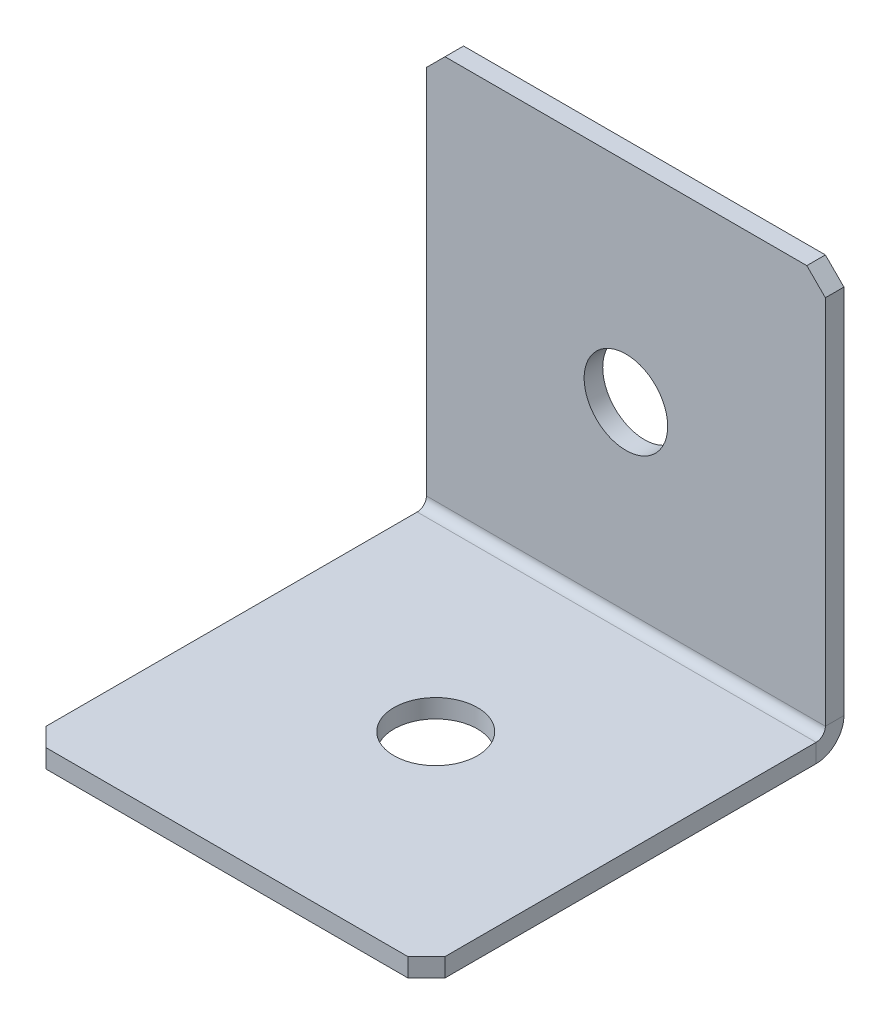
ISO-10303-21;
HEADER;
FILE_DESCRIPTION(('STEP AP214'),'2;1');
FILE_NAME('part.step','',(''),(''),'','','');
FILE_SCHEMA(('AUTOMOTIVE_DESIGN { 1 0 10303 214 1 1 1 1 }'));
ENDSEC;
DATA;
#1=APPLICATION_CONTEXT('core data for automotive mechanical design processes');
#2=APPLICATION_PROTOCOL_DEFINITION('international standard','automotive_design',2000,#1);
#3=PRODUCT_CONTEXT('',#1,'mechanical');
#4=PRODUCT('Part','Part','',(#3));
#5=PRODUCT_RELATED_PRODUCT_CATEGORY('part','',(#4));
#6=PRODUCT_DEFINITION_FORMATION('','',#4);
#7=PRODUCT_DEFINITION_CONTEXT('part definition',#1,'design');
#8=PRODUCT_DEFINITION('design','',#6,#7);
#9=PRODUCT_DEFINITION_SHAPE('','',#8);
#10=(LENGTH_UNIT() NAMED_UNIT(*) SI_UNIT(.MILLI.,.METRE.));
#11=(NAMED_UNIT(*) PLANE_ANGLE_UNIT() SI_UNIT($,.RADIAN.));
#12=(NAMED_UNIT(*) SI_UNIT($,.STERADIAN.) SOLID_ANGLE_UNIT());
#13=UNCERTAINTY_MEASURE_WITH_UNIT(LENGTH_MEASURE(1.E-05),#10,'distance_accuracy_value','');
#14=(GEOMETRIC_REPRESENTATION_CONTEXT(3) GLOBAL_UNCERTAINTY_ASSIGNED_CONTEXT((#13)) GLOBAL_UNIT_ASSIGNED_CONTEXT((#10,
#11,#12)) REPRESENTATION_CONTEXT('',''));
#15=CARTESIAN_POINT('',(0.,0.,0.));
#16=DIRECTION('',(0.,0.,1.));
#17=DIRECTION('',(1.,0.,0.));
#18=AXIS2_PLACEMENT_3D('',#15,#16,#17);
#19=CARTESIAN_POINT('',(0.,0.,2.));
#20=DIRECTION('',(0.,0.,-1.));
#21=DIRECTION('',(-1.,0.,0.));
#22=AXIS2_PLACEMENT_3D('',#19,#20,#21);
#23=PLANE('',#22);
#24=DIRECTION('',(0.,1.,0.));
#25=VECTOR('',#24,1.);
#26=CARTESIAN_POINT('',(21.5,0.,2.));
#27=LINE('',#26,#25);
#28=CARTESIAN_POINT('',(21.5,3.,2.));
#29=VERTEX_POINT('',#28);
#30=CARTESIAN_POINT('',(21.5,43.,2.));
#31=VERTEX_POINT('',#30);
#32=EDGE_CURVE('E224',#29,#31,#27,.T.);
#33=ORIENTED_EDGE('',*,*,#32,.T.);
#34=DIRECTION('',(0.707106781186549,-0.707106781186546,0.));
#35=VECTOR('',#34,1.);
#36=CARTESIAN_POINT('',(21.5,43.,2.));
#37=LINE('',#36,#35);
#38=CARTESIAN_POINT('',(19.5,45.,2.));
#39=VERTEX_POINT('',#38);
#40=EDGE_CURVE('E258',#31,#39,#37,.F.);
#41=ORIENTED_EDGE('',*,*,#40,.T.);
#42=DIRECTION('',(-1.,0.,0.));
#43=VECTOR('',#42,1.);
#44=CARTESIAN_POINT('',(-21.5,45.,2.));
#45=LINE('',#44,#43);
#46=CARTESIAN_POINT('',(-19.5,45.,2.));
#47=VERTEX_POINT('',#46);
#48=EDGE_CURVE('E228',#39,#47,#45,.T.);
#49=ORIENTED_EDGE('',*,*,#48,.T.);
#50=DIRECTION('',(0.707106781186546,0.707106781186549,0.));
#51=VECTOR('',#50,1.);
#52=CARTESIAN_POINT('',(-19.5,45.,2.));
#53=LINE('',#52,#51);
#54=CARTESIAN_POINT('',(-21.5,43.,2.));
#55=VERTEX_POINT('',#54);
#56=EDGE_CURVE('E256',#47,#55,#53,.F.);
#57=ORIENTED_EDGE('',*,*,#56,.T.);
#58=DIRECTION('',(0.,-1.,0.));
#59=VECTOR('',#58,1.);
#60=CARTESIAN_POINT('',(-21.5,0.,2.));
#61=LINE('',#60,#59);
#62=CARTESIAN_POINT('',(-21.5,3.,2.));
#63=VERTEX_POINT('',#62);
#64=EDGE_CURVE('E222',#55,#63,#61,.T.);
#65=ORIENTED_EDGE('',*,*,#64,.T.);
#66=DIRECTION('',(1.,0.,0.));
#67=VECTOR('',#66,1.);
#68=CARTESIAN_POINT('',(21.5,3.,2.));
#69=LINE('',#68,#67);
#70=EDGE_CURVE('E213',#29,#63,#69,.F.);
#71=ORIENTED_EDGE('',*,*,#70,.F.);
#72=EDGE_LOOP('',(#33,#41,#49,#57,#65,#71));
#73=FACE_BOUND('',#72,.T.);
#74=CARTESIAN_POINT('',(0.,22.5,2.));
#75=DIRECTION('',(0.,0.,1.));
#76=DIRECTION('',(1.,0.,0.));
#77=AXIS2_PLACEMENT_3D('',#74,#75,#76);
#78=CIRCLE('',#77,4.5);
#79=CARTESIAN_POINT('',(4.5,22.5,2.));
#80=VERTEX_POINT('',#79);
#81=EDGE_CURVE('E516',#80,#80,#78,.T.);
#82=ORIENTED_EDGE('',*,*,#81,.F.);
#83=EDGE_LOOP('',(#82));
#84=FACE_BOUND('',#83,.T.);
#85=ADVANCED_FACE('F62',(#73,#84),#23,.F.);
#86=CARTESIAN_POINT('',(21.5,0.,2.));
#87=DIRECTION('',(-1.,0.,0.));
#88=DIRECTION('',(0.,1.,0.));
#89=AXIS2_PLACEMENT_3D('',#86,#87,#88);
#90=PLANE('',#89);
#91=DIRECTION('',(0.,1.,0.));
#92=VECTOR('',#91,1.);
#93=CARTESIAN_POINT('',(21.5,0.,0.));
#94=LINE('',#93,#92);
#95=CARTESIAN_POINT('',(21.5,3.,0.));
#96=VERTEX_POINT('',#95);
#97=CARTESIAN_POINT('',(21.5,43.,0.));
#98=VERTEX_POINT('',#97);
#99=EDGE_CURVE('E233',#96,#98,#94,.T.);
#100=ORIENTED_EDGE('',*,*,#99,.T.);
#101=DIRECTION('',(0.,0.,-1.));
#102=VECTOR('',#101,1.);
#103=CARTESIAN_POINT('',(21.5,43.,2.));
#104=LINE('',#103,#102);
#105=EDGE_CURVE('E253',#98,#31,#104,.F.);
#106=ORIENTED_EDGE('',*,*,#105,.T.);
#107=ORIENTED_EDGE('',*,*,#32,.F.);
#108=DIRECTION('',(0.,0.,-1.));
#109=VECTOR('',#108,1.);
#110=CARTESIAN_POINT('',(21.5,3.,2.));
#111=LINE('',#110,#109);
#112=EDGE_CURVE('E209',#29,#96,#111,.T.);
#113=ORIENTED_EDGE('',*,*,#112,.T.);
#114=EDGE_LOOP('',(#100,#106,#107,#113));
#115=FACE_BOUND('',#114,.T.);
#116=ADVANCED_FACE('F272',(#115),#90,.F.);
#117=CARTESIAN_POINT('',(0.,0.,0.));
#118=DIRECTION('',(0.,0.,-1.));
#119=DIRECTION('',(-1.,0.,0.));
#120=AXIS2_PLACEMENT_3D('',#117,#118,#119);
#121=PLANE('',#120);
#122=CARTESIAN_POINT('',(0.,22.5,0.));
#123=DIRECTION('',(0.,0.,-1.));
#124=DIRECTION('',(-1.,0.,0.));
#125=AXIS2_PLACEMENT_3D('',#122,#123,#124);
#126=CIRCLE('',#125,4.5);
#127=CARTESIAN_POINT('',(-4.5,22.5,0.));
#128=VERTEX_POINT('',#127);
#129=EDGE_CURVE('E206',#128,#128,#126,.T.);
#130=ORIENTED_EDGE('',*,*,#129,.F.);
#131=EDGE_LOOP('',(#130));
#132=FACE_BOUND('',#131,.T.);
#133=DIRECTION('',(-1.,0.,0.));
#134=VECTOR('',#133,1.);
#135=CARTESIAN_POINT('',(0.,45.,0.));
#136=LINE('',#135,#134);
#137=CARTESIAN_POINT('',(19.5,45.,0.));
#138=VERTEX_POINT('',#137);
#139=CARTESIAN_POINT('',(-19.5,45.,0.));
#140=VERTEX_POINT('',#139);
#141=EDGE_CURVE('E225',#138,#140,#136,.T.);
#142=ORIENTED_EDGE('',*,*,#141,.F.);
#143=DIRECTION('',(-0.707106781186549,0.707106781186546,0.));
#144=VECTOR('',#143,1.);
#145=CARTESIAN_POINT('',(32.25,32.2500000000001,0.));
#146=LINE('',#145,#144);
#147=EDGE_CURVE('E71',#138,#98,#146,.F.);
#148=ORIENTED_EDGE('',*,*,#147,.T.);
#149=ORIENTED_EDGE('',*,*,#99,.F.);
#150=DIRECTION('',(1.,0.,0.));
#151=VECTOR('',#150,1.);
#152=CARTESIAN_POINT('',(21.5,3.,0.));
#153=LINE('',#152,#151);
#154=CARTESIAN_POINT('',(-21.5,3.00000000000001,0.));
#155=VERTEX_POINT('',#154);
#156=EDGE_CURVE('E160',#96,#155,#153,.F.);
#157=ORIENTED_EDGE('',*,*,#156,.T.);
#158=DIRECTION('',(0.,1.,0.));
#159=VECTOR('',#158,1.);
#160=CARTESIAN_POINT('',(-21.5,0.,0.));
#161=LINE('',#160,#159);
#162=CARTESIAN_POINT('',(-21.5,43.,0.));
#163=VERTEX_POINT('',#162);
#164=EDGE_CURVE('E220',#163,#155,#161,.F.);
#165=ORIENTED_EDGE('',*,*,#164,.F.);
#166=DIRECTION('',(-0.707106781186546,-0.707106781186549,0.));
#167=VECTOR('',#166,1.);
#168=CARTESIAN_POINT('',(-32.25,32.2499999999999,0.));
#169=LINE('',#168,#167);
#170=EDGE_CURVE('E83',#163,#140,#169,.F.);
#171=ORIENTED_EDGE('',*,*,#170,.T.);
#172=EDGE_LOOP('',(#142,#148,#149,#157,#165,#171));
#173=FACE_BOUND('',#172,.T.);
#174=ADVANCED_FACE('F267',(#132,#173),#121,.T.);
#175=CARTESIAN_POINT('',(-21.5,45.,2.));
#176=DIRECTION('',(0.,-1.,0.));
#177=DIRECTION('',(-1.,0.,0.));
#178=AXIS2_PLACEMENT_3D('',#175,#176,#177);
#179=PLANE('',#178);
#180=ORIENTED_EDGE('',*,*,#48,.F.);
#181=DIRECTION('',(0.,0.,1.));
#182=VECTOR('',#181,1.);
#183=CARTESIAN_POINT('',(19.5,45.,2.));
#184=LINE('',#183,#182);
#185=EDGE_CURVE('E263',#39,#138,#184,.F.);
#186=ORIENTED_EDGE('',*,*,#185,.T.);
#187=ORIENTED_EDGE('',*,*,#141,.T.);
#188=DIRECTION('',(0.,0.,-1.));
#189=VECTOR('',#188,1.);
#190=CARTESIAN_POINT('',(-19.5,45.,2.));
#191=LINE('',#190,#189);
#192=EDGE_CURVE('E260',#140,#47,#191,.F.);
#193=ORIENTED_EDGE('',*,*,#192,.T.);
#194=EDGE_LOOP('',(#180,#186,#187,#193));
#195=FACE_BOUND('',#194,.T.);
#196=ADVANCED_FACE('F280',(#195),#179,.F.);
#197=CARTESIAN_POINT('',(-21.5,0.,2.));
#198=DIRECTION('',(1.,0.,0.));
#199=DIRECTION('',(0.,-1.,0.));
#200=AXIS2_PLACEMENT_3D('',#197,#198,#199);
#201=PLANE('',#200);
#202=ORIENTED_EDGE('',*,*,#64,.F.);
#203=DIRECTION('',(0.,0.,1.));
#204=VECTOR('',#203,1.);
#205=CARTESIAN_POINT('',(-21.5,43.,2.));
#206=LINE('',#205,#204);
#207=EDGE_CURVE('E13',#55,#163,#206,.F.);
#208=ORIENTED_EDGE('',*,*,#207,.T.);
#209=ORIENTED_EDGE('',*,*,#164,.T.);
#210=DIRECTION('',(0.,0.,-1.));
#211=VECTOR('',#210,1.);
#212=CARTESIAN_POINT('',(-21.5,3.,2.));
#213=LINE('',#212,#211);
#214=EDGE_CURVE('E217',#63,#155,#213,.T.);
#215=ORIENTED_EDGE('',*,*,#214,.F.);
#216=EDGE_LOOP('',(#202,#208,#209,#215));
#217=FACE_BOUND('',#216,.T.);
#218=ADVANCED_FACE('F284',(#217),#201,.F.);
#219=CARTESIAN_POINT('',(-21.5,3.,3.));
#220=DIRECTION('',(-1.,0.,0.));
#221=DIRECTION('',(0.,0.,1.));
#222=AXIS2_PLACEMENT_3D('',#219,#220,#221);
#223=PLANE('',#222);
#224=DIRECTION('',(0.,1.,0.));
#225=VECTOR('',#224,1.);
#226=CARTESIAN_POINT('',(-21.5,0.,2.99999999999999));
#227=LINE('',#226,#225);
#228=CARTESIAN_POINT('',(-21.5,2.,3.));
#229=VERTEX_POINT('',#228);
#230=CARTESIAN_POINT('',(-21.5,0.,2.99999999999999));
#231=VERTEX_POINT('',#230);
#232=EDGE_CURVE('E203',#229,#231,#227,.F.);
#233=ORIENTED_EDGE('',*,*,#232,.F.);
#234=CARTESIAN_POINT('',(-21.5,3.,3.));
#235=DIRECTION('',(1.,0.,0.));
#236=DIRECTION('',(0.,0.,-1.));
#237=AXIS2_PLACEMENT_3D('',#234,#235,#236);
#238=CIRCLE('',#237,1.);
#239=EDGE_CURVE('E163',#63,#229,#238,.F.);
#240=ORIENTED_EDGE('',*,*,#239,.F.);
#241=ORIENTED_EDGE('',*,*,#214,.T.);
#242=CARTESIAN_POINT('',(-21.5,3.,3.));
#243=DIRECTION('',(1.,0.,0.));
#244=DIRECTION('',(0.,0.,-1.));
#245=AXIS2_PLACEMENT_3D('',#242,#243,#244);
#246=CIRCLE('',#245,3.);
#247=EDGE_CURVE('E208',#155,#231,#246,.F.);
#248=ORIENTED_EDGE('',*,*,#247,.T.);
#249=EDGE_LOOP('',(#233,#240,#241,#248));
#250=FACE_BOUND('',#249,.T.);
#251=ADVANCED_FACE('F288',(#250),#223,.T.);
#252=CARTESIAN_POINT('',(21.5,3.,3.));
#253=DIRECTION('',(-1.,0.,0.));
#254=DIRECTION('',(0.,0.,1.));
#255=AXIS2_PLACEMENT_3D('',#252,#253,#254);
#256=PLANE('',#255);
#257=CARTESIAN_POINT('',(21.5,3.,3.));
#258=DIRECTION('',(1.,0.,0.));
#259=DIRECTION('',(0.,0.,-1.));
#260=AXIS2_PLACEMENT_3D('',#257,#258,#259);
#261=CIRCLE('',#260,1.);
#262=CARTESIAN_POINT('',(21.5,2.,3.));
#263=VERTEX_POINT('',#262);
#264=EDGE_CURVE('E170',#263,#29,#261,.T.);
#265=ORIENTED_EDGE('',*,*,#264,.F.);
#266=DIRECTION('',(0.,1.,0.));
#267=VECTOR('',#266,1.);
#268=CARTESIAN_POINT('',(21.5,2.,3.));
#269=LINE('',#268,#267);
#270=CARTESIAN_POINT('',(21.5,0.,2.99999999999999));
#271=VERTEX_POINT('',#270);
#272=EDGE_CURVE('E167',#263,#271,#269,.F.);
#273=ORIENTED_EDGE('',*,*,#272,.T.);
#274=CARTESIAN_POINT('',(21.5,3.,3.));
#275=DIRECTION('',(1.,0.,0.));
#276=DIRECTION('',(0.,0.,-1.));
#277=AXIS2_PLACEMENT_3D('',#274,#275,#276);
#278=CIRCLE('',#277,3.);
#279=EDGE_CURVE('E152',#271,#96,#278,.T.);
#280=ORIENTED_EDGE('',*,*,#279,.T.);
#281=ORIENTED_EDGE('',*,*,#112,.F.);
#282=EDGE_LOOP('',(#265,#273,#280,#281));
#283=FACE_BOUND('',#282,.T.);
#284=ADVANCED_FACE('F168',(#283),#256,.F.);
#285=CARTESIAN_POINT('',(21.5,3.,3.));
#286=DIRECTION('',(1.,0.,0.));
#287=DIRECTION('',(0.,-1.,0.));
#288=AXIS2_PLACEMENT_3D('',#285,#286,#287);
#289=CYLINDRICAL_SURFACE('',#288,3.);
#290=ORIENTED_EDGE('',*,*,#156,.F.);
#291=ORIENTED_EDGE('',*,*,#279,.F.);
#292=DIRECTION('',(1.,0.,0.));
#293=VECTOR('',#292,1.);
#294=CARTESIAN_POINT('',(-21.5,0.,2.99999999999999));
#295=LINE('',#294,#293);
#296=EDGE_CURVE('E157',#271,#231,#295,.F.);
#297=ORIENTED_EDGE('',*,*,#296,.T.);
#298=ORIENTED_EDGE('',*,*,#247,.F.);
#299=EDGE_LOOP('',(#290,#291,#297,#298));
#300=FACE_BOUND('',#299,.T.);
#301=ADVANCED_FACE('F154',(#300),#289,.T.);
#302=CARTESIAN_POINT('',(21.5,3.,3.));
#303=DIRECTION('',(1.,0.,0.));
#304=DIRECTION('',(0.,-1.,0.));
#305=AXIS2_PLACEMENT_3D('',#302,#303,#304);
#306=CYLINDRICAL_SURFACE('',#305,1.);
#307=ORIENTED_EDGE('',*,*,#70,.T.);
#308=ORIENTED_EDGE('',*,*,#239,.T.);
#309=DIRECTION('',(1.,0.,0.));
#310=VECTOR('',#309,1.);
#311=CARTESIAN_POINT('',(-21.5,2.,3.));
#312=LINE('',#311,#310);
#313=EDGE_CURVE('E175',#229,#263,#312,.T.);
#314=ORIENTED_EDGE('',*,*,#313,.T.);
#315=ORIENTED_EDGE('',*,*,#264,.T.);
#316=EDGE_LOOP('',(#307,#308,#314,#315));
#317=FACE_BOUND('',#316,.T.);
#318=ADVANCED_FACE('F291',(#317),#306,.F.);
#319=CARTESIAN_POINT('',(-21.5,0.,1.99999999999999));
#320=DIRECTION('',(1.,0.,0.));
#321=DIRECTION('',(0.,0.,-1.));
#322=AXIS2_PLACEMENT_3D('',#319,#320,#321);
#323=PLANE('',#322);
#324=DIRECTION('',(0.,0.,-1.));
#325=VECTOR('',#324,1.);
#326=CARTESIAN_POINT('',(-21.5,0.,0.));
#327=LINE('',#326,#325);
#328=CARTESIAN_POINT('',(-21.5,-1.43194803666348E-13,43.));
#329=VERTEX_POINT('',#328);
#330=EDGE_CURVE('E183',#329,#231,#327,.T.);
#331=ORIENTED_EDGE('',*,*,#330,.F.);
#332=DIRECTION('',(0.,1.,0.));
#333=VECTOR('',#332,1.);
#334=CARTESIAN_POINT('',(-21.5,-1.43150734892568E-13,43.));
#335=LINE('',#334,#333);
#336=CARTESIAN_POINT('',(-21.5,1.99999999999986,43.));
#337=VERTEX_POINT('',#336);
#338=EDGE_CURVE('E250',#329,#337,#335,.T.);
#339=ORIENTED_EDGE('',*,*,#338,.T.);
#340=DIRECTION('',(0.,0.,1.));
#341=VECTOR('',#340,1.);
#342=CARTESIAN_POINT('',(-21.5,2.,2.));
#343=LINE('',#342,#341);
#344=EDGE_CURVE('E184',#337,#229,#343,.F.);
#345=ORIENTED_EDGE('',*,*,#344,.T.);
#346=ORIENTED_EDGE('',*,*,#232,.T.);
#347=EDGE_LOOP('',(#331,#339,#345,#346));
#348=FACE_BOUND('',#347,.T.);
#349=ADVANCED_FACE('F308',(#348),#323,.F.);
#350=CARTESIAN_POINT('',(21.5,-1.50053580671994E-13,45.));
#351=DIRECTION('',(-1.,0.,0.));
#352=DIRECTION('',(0.,0.,1.));
#353=AXIS2_PLACEMENT_3D('',#350,#351,#352);
#354=PLANE('',#353);
#355=DIRECTION('',(0.,0.,-1.));
#356=VECTOR('',#355,1.);
#357=CARTESIAN_POINT('',(21.5,1.99999999999985,45.));
#358=LINE('',#357,#356);
#359=CARTESIAN_POINT('',(21.5,1.99999999999986,43.));
#360=VERTEX_POINT('',#359);
#361=EDGE_CURVE('E199',#263,#360,#358,.F.);
#362=ORIENTED_EDGE('',*,*,#361,.T.);
#363=DIRECTION('',(0.,-1.,0.));
#364=VECTOR('',#363,1.);
#365=CARTESIAN_POINT('',(21.5,-1.43070617994308E-13,43.));
#366=LINE('',#365,#364);
#367=CARTESIAN_POINT('',(21.5,-1.43194803666348E-13,43.));
#368=VERTEX_POINT('',#367);
#369=EDGE_CURVE('E188',#360,#368,#366,.T.);
#370=ORIENTED_EDGE('',*,*,#369,.T.);
#371=DIRECTION('',(0.,0.,1.));
#372=VECTOR('',#371,1.);
#373=CARTESIAN_POINT('',(21.5,0.,0.));
#374=LINE('',#373,#372);
#375=EDGE_CURVE('E180',#271,#368,#374,.T.);
#376=ORIENTED_EDGE('',*,*,#375,.F.);
#377=ORIENTED_EDGE('',*,*,#272,.F.);
#378=EDGE_LOOP('',(#362,#370,#376,#377));
#379=FACE_BOUND('',#378,.T.);
#380=ADVANCED_FACE('F186',(#379),#354,.F.);
#381=CARTESIAN_POINT('',(0.,0.,0.));
#382=DIRECTION('',(0.,1.,0.));
#383=DIRECTION('',(0.,0.,1.));
#384=AXIS2_PLACEMENT_3D('',#381,#382,#383);
#385=PLANE('',#384);
#386=CARTESIAN_POINT('',(0.,0.,22.5));
#387=DIRECTION('',(0.,1.,0.));
#388=DIRECTION('',(0.,0.,1.));
#389=AXIS2_PLACEMENT_3D('',#386,#387,#388);
#390=CIRCLE('',#389,4.5);
#391=CARTESIAN_POINT('',(0.,0.,27.));
#392=VERTEX_POINT('',#391);
#393=EDGE_CURVE('E519',#392,#392,#390,.T.);
#394=ORIENTED_EDGE('',*,*,#393,.T.);
#395=EDGE_LOOP('',(#394));
#396=FACE_BOUND('',#395,.T.);
#397=ORIENTED_EDGE('',*,*,#375,.T.);
#398=DIRECTION('',(0.707106781186547,0.,-0.707106781186548));
#399=VECTOR('',#398,1.);
#400=CARTESIAN_POINT('',(19.5,-1.50053580671994E-13,45.));
#401=LINE('',#400,#399);
#402=CARTESIAN_POINT('',(19.5,-1.50177766344034E-13,45.));
#403=VERTEX_POINT('',#402);
#404=EDGE_CURVE('E248',#368,#403,#401,.F.);
#405=ORIENTED_EDGE('',*,*,#404,.T.);
#406=DIRECTION('',(-1.,0.,0.));
#407=VECTOR('',#406,1.);
#408=CARTESIAN_POINT('',(0.,-1.50177766344034E-13,45.));
#409=LINE('',#408,#407);
#410=CARTESIAN_POINT('',(-19.5,-1.50177766344034E-13,45.));
#411=VERTEX_POINT('',#410);
#412=EDGE_CURVE('E189',#403,#411,#409,.T.);
#413=ORIENTED_EDGE('',*,*,#412,.T.);
#414=DIRECTION('',(0.707106781186549,0.,0.707106781186546));
#415=VECTOR('',#414,1.);
#416=CARTESIAN_POINT('',(-21.5,-1.43150734892568E-13,43.));
#417=LINE('',#416,#415);
#418=EDGE_CURVE('E246',#411,#329,#417,.F.);
#419=ORIENTED_EDGE('',*,*,#418,.T.);
#420=ORIENTED_EDGE('',*,*,#330,.T.);
#421=ORIENTED_EDGE('',*,*,#296,.F.);
#422=EDGE_LOOP('',(#397,#405,#413,#419,#420,#421));
#423=FACE_BOUND('',#422,.T.);
#424=ADVANCED_FACE('F179',(#396,#423),#385,.F.);
#425=CARTESIAN_POINT('',(0.,2.00000000000001,0.));
#426=DIRECTION('',(0.,1.,0.));
#427=DIRECTION('',(0.,0.,1.));
#428=AXIS2_PLACEMENT_3D('',#425,#426,#427);
#429=PLANE('',#428);
#430=CARTESIAN_POINT('',(0.,1.99999999999993,22.5));
#431=DIRECTION('',(0.,1.,0.));
#432=DIRECTION('',(0.,0.,1.));
#433=AXIS2_PLACEMENT_3D('',#430,#431,#432);
#434=CIRCLE('',#433,4.5);
#435=CARTESIAN_POINT('',(0.,1.99999999999991,27.));
#436=VERTEX_POINT('',#435);
#437=EDGE_CURVE('E524',#436,#436,#434,.T.);
#438=ORIENTED_EDGE('',*,*,#437,.F.);
#439=EDGE_LOOP('',(#438));
#440=FACE_BOUND('',#439,.T.);
#441=DIRECTION('',(1.,0.,0.));
#442=VECTOR('',#441,1.);
#443=CARTESIAN_POINT('',(-21.5,1.99999999999985,45.));
#444=LINE('',#443,#442);
#445=CARTESIAN_POINT('',(19.5,1.99999999999985,45.));
#446=VERTEX_POINT('',#445);
#447=CARTESIAN_POINT('',(-19.5,1.99999999999985,45.));
#448=VERTEX_POINT('',#447);
#449=EDGE_CURVE('E193',#446,#448,#444,.F.);
#450=ORIENTED_EDGE('',*,*,#449,.F.);
#451=DIRECTION('',(-0.707106781186547,0.,0.707106781186548));
#452=VECTOR('',#451,1.);
#453=CARTESIAN_POINT('',(32.25,1.99999999999989,32.25));
#454=LINE('',#453,#452);
#455=EDGE_CURVE('E243',#446,#360,#454,.F.);
#456=ORIENTED_EDGE('',*,*,#455,.T.);
#457=ORIENTED_EDGE('',*,*,#361,.F.);
#458=ORIENTED_EDGE('',*,*,#313,.F.);
#459=ORIENTED_EDGE('',*,*,#344,.F.);
#460=DIRECTION('',(-0.707106781186549,0.,-0.707106781186546));
#461=VECTOR('',#460,1.);
#462=CARTESIAN_POINT('',(-32.25,1.99999999999989,32.2500000000001));
#463=LINE('',#462,#461);
#464=EDGE_CURVE('E241',#337,#448,#463,.F.);
#465=ORIENTED_EDGE('',*,*,#464,.T.);
#466=EDGE_LOOP('',(#450,#456,#457,#458,#459,#465));
#467=FACE_BOUND('',#466,.T.);
#468=ADVANCED_FACE('F295',(#440,#467),#429,.T.);
#469=CARTESIAN_POINT('',(-21.5,-1.50053580671994E-13,45.));
#470=DIRECTION('',(0.,0.,-1.));
#471=DIRECTION('',(0.,1.,0.));
#472=AXIS2_PLACEMENT_3D('',#469,#470,#471);
#473=PLANE('',#472);
#474=ORIENTED_EDGE('',*,*,#412,.F.);
#475=DIRECTION('',(0.,1.,0.));
#476=VECTOR('',#475,1.);
#477=CARTESIAN_POINT('',(19.5,-1.50053580671994E-13,45.));
#478=LINE('',#477,#476);
#479=EDGE_CURVE('E238',#403,#446,#478,.T.);
#480=ORIENTED_EDGE('',*,*,#479,.T.);
#481=ORIENTED_EDGE('',*,*,#449,.T.);
#482=DIRECTION('',(0.,-1.,0.));
#483=VECTOR('',#482,1.);
#484=CARTESIAN_POINT('',(-19.5,-1.50053580671994E-13,45.));
#485=LINE('',#484,#483);
#486=EDGE_CURVE('E231',#448,#411,#485,.T.);
#487=ORIENTED_EDGE('',*,*,#486,.T.);
#488=EDGE_LOOP('',(#474,#480,#481,#487));
#489=FACE_BOUND('',#488,.T.);
#490=ADVANCED_FACE('F302',(#489),#473,.F.);
#491=CARTESIAN_POINT('',(0.,22.5,2.));
#492=DIRECTION('',(0.,0.,1.));
#493=DIRECTION('',(1.,0.,0.));
#494=AXIS2_PLACEMENT_3D('',#491,#492,#493);
#495=CYLINDRICAL_SURFACE('',#494,4.5);
#496=ORIENTED_EDGE('',*,*,#81,.T.);
#497=EDGE_LOOP('',(#496));
#498=FACE_BOUND('',#497,.T.);
#499=ORIENTED_EDGE('',*,*,#129,.T.);
#500=EDGE_LOOP('',(#499));
#501=FACE_BOUND('',#500,.T.);
#502=ADVANCED_FACE('F380',(#498,#501),#495,.F.);
#503=CARTESIAN_POINT('',(0.,1.99999999999993,22.5));
#504=DIRECTION('',(0.,1.,0.));
#505=DIRECTION('',(0.,0.,1.));
#506=AXIS2_PLACEMENT_3D('',#503,#504,#505);
#507=CYLINDRICAL_SURFACE('',#506,4.5);
#508=ORIENTED_EDGE('',*,*,#393,.F.);
#509=EDGE_LOOP('',(#508));
#510=FACE_BOUND('',#509,.T.);
#511=ORIENTED_EDGE('',*,*,#437,.T.);
#512=EDGE_LOOP('',(#511));
#513=FACE_BOUND('',#512,.T.);
#514=ADVANCED_FACE('F340',(#510,#513),#507,.F.);
#515=CARTESIAN_POINT('',(19.5,-1.50053580671994E-13,45.));
#516=DIRECTION('',(-0.707106781186548,0.,-0.707106781186547));
#517=DIRECTION('',(0.,1.,0.));
#518=AXIS2_PLACEMENT_3D('',#515,#516,#517);
#519=PLANE('',#518);
#520=ORIENTED_EDGE('',*,*,#404,.F.);
#521=ORIENTED_EDGE('',*,*,#369,.F.);
#522=ORIENTED_EDGE('',*,*,#455,.F.);
#523=ORIENTED_EDGE('',*,*,#479,.F.);
#524=EDGE_LOOP('',(#520,#521,#522,#523));
#525=FACE_BOUND('',#524,.T.);
#526=ADVANCED_FACE('F297',(#525),#519,.F.);
#527=CARTESIAN_POINT('',(-21.5,-1.43150734892568E-13,43.));
#528=DIRECTION('',(0.707106781186546,0.,-0.707106781186549));
#529=DIRECTION('',(0.,1.,0.));
#530=AXIS2_PLACEMENT_3D('',#527,#528,#529);
#531=PLANE('',#530);
#532=ORIENTED_EDGE('',*,*,#418,.F.);
#533=ORIENTED_EDGE('',*,*,#486,.F.);
#534=ORIENTED_EDGE('',*,*,#464,.F.);
#535=ORIENTED_EDGE('',*,*,#338,.F.);
#536=EDGE_LOOP('',(#532,#533,#534,#535));
#537=FACE_BOUND('',#536,.T.);
#538=ADVANCED_FACE('F305',(#537),#531,.F.);
#539=CARTESIAN_POINT('',(21.5,43.,2.));
#540=DIRECTION('',(-0.707106781186546,-0.707106781186549,0.));
#541=DIRECTION('',(0.,0.,1.));
#542=AXIS2_PLACEMENT_3D('',#539,#540,#541);
#543=PLANE('',#542);
#544=ORIENTED_EDGE('',*,*,#147,.F.);
#545=ORIENTED_EDGE('',*,*,#185,.F.);
#546=ORIENTED_EDGE('',*,*,#40,.F.);
#547=ORIENTED_EDGE('',*,*,#105,.F.);
#548=EDGE_LOOP('',(#544,#545,#546,#547));
#549=FACE_BOUND('',#548,.T.);
#550=ADVANCED_FACE('F274',(#549),#543,.F.);
#551=CARTESIAN_POINT('',(-19.5,45.,2.));
#552=DIRECTION('',(0.707106781186549,-0.707106781186546,0.));
#553=DIRECTION('',(0.,0.,1.));
#554=AXIS2_PLACEMENT_3D('',#551,#552,#553);
#555=PLANE('',#554);
#556=ORIENTED_EDGE('',*,*,#170,.F.);
#557=ORIENTED_EDGE('',*,*,#207,.F.);
#558=ORIENTED_EDGE('',*,*,#56,.F.);
#559=ORIENTED_EDGE('',*,*,#192,.F.);
#560=EDGE_LOOP('',(#556,#557,#558,#559));
#561=FACE_BOUND('',#560,.T.);
#562=ADVANCED_FACE('F65',(#561),#555,.F.);
#563=CLOSED_SHELL('',(#85,#116,#174,#196,#218,#251,#284,#301,#318,#349,#380,#424,#468,#490,#502,
#514,#526,#538,#550,#562));
#564=MANIFOLD_SOLID_BREP('B2',#563);
#565=ADVANCED_BREP_SHAPE_REPRESENTATION('',(#18,#564),#14);
#566=SHAPE_DEFINITION_REPRESENTATION(#9,#565);
ENDSEC;
END-ISO-10303-21;
